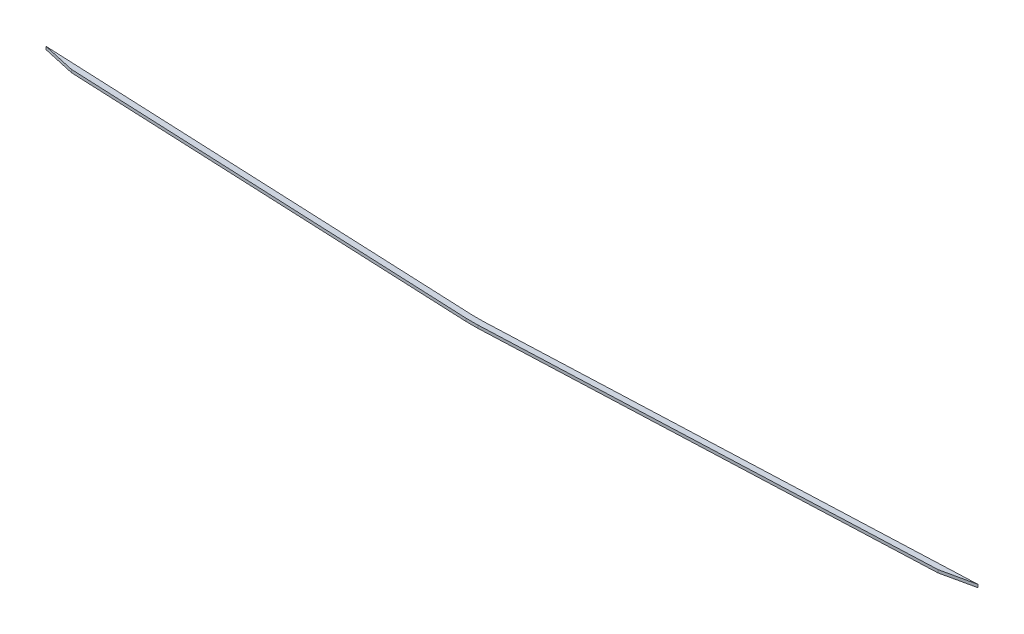
ISO-10303-21;
HEADER;
FILE_DESCRIPTION(('STEP AP214'),'2;1');
FILE_NAME('part.step','',(''),(''),'','','');
FILE_SCHEMA(('AUTOMOTIVE_DESIGN { 1 0 10303 214 1 1 1 1 }'));
ENDSEC;
DATA;
#1=APPLICATION_CONTEXT('core data for automotive mechanical design processes');
#2=APPLICATION_PROTOCOL_DEFINITION('international standard','automotive_design',2000,#1);
#3=PRODUCT_CONTEXT('',#1,'mechanical');
#4=PRODUCT('Part','Part','',(#3));
#5=PRODUCT_RELATED_PRODUCT_CATEGORY('part','',(#4));
#6=PRODUCT_DEFINITION_FORMATION('','',#4);
#7=PRODUCT_DEFINITION_CONTEXT('part definition',#1,'design');
#8=PRODUCT_DEFINITION('design','',#6,#7);
#9=PRODUCT_DEFINITION_SHAPE('','',#8);
#10=(LENGTH_UNIT() NAMED_UNIT(*) SI_UNIT(.MILLI.,.METRE.));
#11=(NAMED_UNIT(*) PLANE_ANGLE_UNIT() SI_UNIT($,.RADIAN.));
#12=(NAMED_UNIT(*) SI_UNIT($,.STERADIAN.) SOLID_ANGLE_UNIT());
#13=UNCERTAINTY_MEASURE_WITH_UNIT(LENGTH_MEASURE(1.E-05),#10,'distance_accuracy_value','');
#14=(GEOMETRIC_REPRESENTATION_CONTEXT(3) GLOBAL_UNCERTAINTY_ASSIGNED_CONTEXT((#13)) GLOBAL_UNIT_ASSIGNED_CONTEXT((#10,
#11,#12)) REPRESENTATION_CONTEXT('',''));
#15=CARTESIAN_POINT('',(0.,0.,0.));
#16=DIRECTION('',(0.,0.,1.));
#17=DIRECTION('',(1.,0.,0.));
#18=AXIS2_PLACEMENT_3D('',#15,#16,#17);
#19=CARTESIAN_POINT('',(-6.,1.5,-6.));
#20=DIRECTION('',(0.,0.,1.));
#21=DIRECTION('',(1.,0.,0.));
#22=AXIS2_PLACEMENT_3D('',#19,#20,#21);
#23=PLANE('',#22);
#24=DIRECTION('',(-1.,0.,0.));
#25=VECTOR('',#24,1.);
#26=CARTESIAN_POINT('',(-6.,-1.5,-6.));
#27=LINE('',#26,#25);
#28=CARTESIAN_POINT('',(6.,-1.5,-6.));
#29=VERTEX_POINT('',#28);
#30=CARTESIAN_POINT('',(-6.,-1.5,-6.));
#31=VERTEX_POINT('',#30);
#32=EDGE_CURVE('E99',#29,#31,#27,.T.);
#33=ORIENTED_EDGE('',*,*,#32,.T.);
#34=DIRECTION('',(0.,-1.,0.));
#35=VECTOR('',#34,1.);
#36=CARTESIAN_POINT('',(-6.,1.5,-6.));
#37=LINE('',#36,#35);
#38=CARTESIAN_POINT('',(-6.,1.5,-6.));
#39=VERTEX_POINT('',#38);
#40=EDGE_CURVE('E11',#39,#31,#37,.T.);
#41=ORIENTED_EDGE('',*,*,#40,.F.);
#42=DIRECTION('',(-1.,0.,0.));
#43=VECTOR('',#42,1.);
#44=CARTESIAN_POINT('',(-6.,1.5,-6.));
#45=LINE('',#44,#43);
#46=CARTESIAN_POINT('',(6.,1.5,-6.));
#47=VERTEX_POINT('',#46);
#48=EDGE_CURVE('E126',#47,#39,#45,.T.);
#49=ORIENTED_EDGE('',*,*,#48,.F.);
#50=DIRECTION('',(0.,-1.,0.));
#51=VECTOR('',#50,1.);
#52=CARTESIAN_POINT('',(6.,1.5,-6.));
#53=LINE('',#52,#51);
#54=EDGE_CURVE('E112',#47,#29,#53,.T.);
#55=ORIENTED_EDGE('',*,*,#54,.T.);
#56=EDGE_LOOP('',(#33,#41,#49,#55));
#57=FACE_BOUND('',#56,.T.);
#58=ADVANCED_FACE('F31',(#57),#23,.F.);
#59=CARTESIAN_POINT('',(-6.,1.5,-6.));
#60=DIRECTION('',(-0.0440101798517303,0.,0.999031082634278));
#61=DIRECTION('',(0.999031082634279,0.,0.0440101798517303));
#62=AXIS2_PLACEMENT_3D('',#59,#60,#61);
#63=PLANE('',#62);
#64=DIRECTION('',(-0.999031082634278,0.,-0.0440101798517303));
#65=VECTOR('',#64,1.);
#66=CARTESIAN_POINT('',(-6.,-1.5,-6.));
#67=LINE('',#66,#65);
#68=CARTESIAN_POINT('',(-465.,-1.5,-26.2202643171806));
#69=VERTEX_POINT('',#68);
#70=EDGE_CURVE('E95',#31,#69,#67,.T.);
#71=ORIENTED_EDGE('',*,*,#70,.T.);
#72=DIRECTION('',(0.,-1.,0.));
#73=VECTOR('',#72,1.);
#74=CARTESIAN_POINT('',(-465.,1.5,-26.2202643171806));
#75=LINE('',#74,#73);
#76=CARTESIAN_POINT('',(-465.,1.5,-26.2202643171806));
#77=VERTEX_POINT('',#76);
#78=EDGE_CURVE('E38',#77,#69,#75,.T.);
#79=ORIENTED_EDGE('',*,*,#78,.F.);
#80=DIRECTION('',(-0.999031082634278,0.,-0.0440101798517303));
#81=VECTOR('',#80,1.);
#82=CARTESIAN_POINT('',(-6.,1.5,-6.));
#83=LINE('',#82,#81);
#84=EDGE_CURVE('E108',#39,#77,#83,.T.);
#85=ORIENTED_EDGE('',*,*,#84,.F.);
#86=ORIENTED_EDGE('',*,*,#40,.T.);
#87=EDGE_LOOP('',(#71,#79,#85,#86));
#88=FACE_BOUND('',#87,.T.);
#89=ADVANCED_FACE('F107',(#88),#63,.F.);
#90=CARTESIAN_POINT('',(-465.,1.5,-26.2202643171806));
#91=DIRECTION('',(0.216821493261509,0.,-0.97621126814837));
#92=DIRECTION('',(-0.976211268148371,0.,-0.216821493261509));
#93=AXIS2_PLACEMENT_3D('',#90,#91,#92);
#94=PLANE('',#93);
#95=DIRECTION('',(0.97621126814837,0.,0.216821493261509));
#96=VECTOR('',#95,1.);
#97=CARTESIAN_POINT('',(-465.,-1.5,-26.2202643171806));
#98=LINE('',#97,#96);
#99=CARTESIAN_POINT('',(-431.302022404104,-1.5,-18.735771912075));
#100=VERTEX_POINT('',#99);
#101=EDGE_CURVE('E101',#69,#100,#98,.T.);
#102=ORIENTED_EDGE('',*,*,#101,.T.);
#103=DIRECTION('',(0.,-1.,0.));
#104=VECTOR('',#103,1.);
#105=CARTESIAN_POINT('',(-431.302022404104,1.5,-18.735771912075));
#106=LINE('',#105,#104);
#107=CARTESIAN_POINT('',(-431.302022404104,1.5,-18.735771912075));
#108=VERTEX_POINT('',#107);
#109=EDGE_CURVE('E152',#108,#100,#106,.T.);
#110=ORIENTED_EDGE('',*,*,#109,.F.);
#111=DIRECTION('',(0.97621126814837,0.,0.216821493261509));
#112=VECTOR('',#111,1.);
#113=CARTESIAN_POINT('',(-465.,1.5,-26.2202643171806));
#114=LINE('',#113,#112);
#115=EDGE_CURVE('E129',#77,#108,#114,.T.);
#116=ORIENTED_EDGE('',*,*,#115,.F.);
#117=ORIENTED_EDGE('',*,*,#78,.T.);
#118=EDGE_LOOP('',(#102,#110,#116,#117));
#119=FACE_BOUND('',#118,.T.);
#120=ADVANCED_FACE('F156',(#119),#94,.F.);
#121=CARTESIAN_POINT('',(-431.302022404104,1.5,-18.735771912075));
#122=DIRECTION('',(0.0440101798517302,0.,-0.999031082634278));
#123=DIRECTION('',(-0.999031082634279,0.,-0.0440101798517302));
#124=AXIS2_PLACEMENT_3D('',#121,#122,#123);
#125=PLANE('',#124);
#126=DIRECTION('',(0.999031082634278,0.,0.0440101798517302));
#127=VECTOR('',#126,1.);
#128=CARTESIAN_POINT('',(-431.302022404104,-1.5,-18.735771912075));
#129=LINE('',#128,#127);
#130=CARTESIAN_POINT('',(-6.,-1.5,0.));
#131=VERTEX_POINT('',#130);
#132=EDGE_CURVE('E116',#100,#131,#129,.T.);
#133=ORIENTED_EDGE('',*,*,#132,.T.);
#134=DIRECTION('',(0.,-1.,0.));
#135=VECTOR('',#134,1.);
#136=CARTESIAN_POINT('',(-6.,1.5,0.));
#137=LINE('',#136,#135);
#138=CARTESIAN_POINT('',(-6.,1.5,0.));
#139=VERTEX_POINT('',#138);
#140=EDGE_CURVE('E149',#139,#131,#137,.T.);
#141=ORIENTED_EDGE('',*,*,#140,.F.);
#142=DIRECTION('',(0.999031082634278,0.,0.0440101798517302));
#143=VECTOR('',#142,1.);
#144=CARTESIAN_POINT('',(-431.302022404104,1.5,-18.735771912075));
#145=LINE('',#144,#143);
#146=EDGE_CURVE('E131',#108,#139,#145,.T.);
#147=ORIENTED_EDGE('',*,*,#146,.F.);
#148=ORIENTED_EDGE('',*,*,#109,.T.);
#149=EDGE_LOOP('',(#133,#141,#147,#148));
#150=FACE_BOUND('',#149,.T.);
#151=ADVANCED_FACE('F164',(#150),#125,.F.);
#152=CARTESIAN_POINT('',(6.,1.5,0.));
#153=DIRECTION('',(0.,0.,-1.));
#154=DIRECTION('',(-1.,0.,0.));
#155=AXIS2_PLACEMENT_3D('',#152,#153,#154);
#156=PLANE('',#155);
#157=DIRECTION('',(1.,0.,0.));
#158=VECTOR('',#157,1.);
#159=CARTESIAN_POINT('',(6.,-1.5,0.));
#160=LINE('',#159,#158);
#161=CARTESIAN_POINT('',(6.,-1.5,0.));
#162=VERTEX_POINT('',#161);
#163=EDGE_CURVE('E118',#131,#162,#160,.T.);
#164=ORIENTED_EDGE('',*,*,#163,.T.);
#165=DIRECTION('',(0.,-1.,0.));
#166=VECTOR('',#165,1.);
#167=CARTESIAN_POINT('',(6.,1.5,0.));
#168=LINE('',#167,#166);
#169=CARTESIAN_POINT('',(6.,1.5,0.));
#170=VERTEX_POINT('',#169);
#171=EDGE_CURVE('E146',#170,#162,#168,.T.);
#172=ORIENTED_EDGE('',*,*,#171,.F.);
#173=DIRECTION('',(1.,0.,0.));
#174=VECTOR('',#173,1.);
#175=CARTESIAN_POINT('',(6.,1.5,0.));
#176=LINE('',#175,#174);
#177=EDGE_CURVE('E133',#139,#170,#176,.T.);
#178=ORIENTED_EDGE('',*,*,#177,.F.);
#179=ORIENTED_EDGE('',*,*,#140,.T.);
#180=EDGE_LOOP('',(#164,#172,#178,#179));
#181=FACE_BOUND('',#180,.T.);
#182=ADVANCED_FACE('F167',(#181),#156,.F.);
#183=CARTESIAN_POINT('',(461.277824715251,1.5,-18.8131332526964));
#184=DIRECTION('',(-0.0412870795456189,0.,-0.999147325003973));
#185=DIRECTION('',(-0.999147325003973,0.,0.0412870795456189));
#186=AXIS2_PLACEMENT_3D('',#183,#184,#185);
#187=PLANE('',#186);
#188=DIRECTION('',(0.999147325003972,0.,-0.0412870795456188));
#189=VECTOR('',#188,1.);
#190=CARTESIAN_POINT('',(461.277824715251,-1.5,-18.8131332526964));
#191=LINE('',#190,#189);
#192=CARTESIAN_POINT('',(461.277824715251,-1.5,-18.8131332526964));
#193=VERTEX_POINT('',#192);
#194=EDGE_CURVE('E120',#162,#193,#191,.T.);
#195=ORIENTED_EDGE('',*,*,#194,.T.);
#196=DIRECTION('',(0.,-1.,0.));
#197=VECTOR('',#196,1.);
#198=CARTESIAN_POINT('',(461.277824715251,1.5,-18.8131332526964));
#199=LINE('',#198,#197);
#200=CARTESIAN_POINT('',(461.277824715251,1.5,-18.8131332526964));
#201=VERTEX_POINT('',#200);
#202=EDGE_CURVE('E143',#201,#193,#199,.T.);
#203=ORIENTED_EDGE('',*,*,#202,.F.);
#204=DIRECTION('',(0.999147325003972,0.,-0.0412870795456188));
#205=VECTOR('',#204,1.);
#206=CARTESIAN_POINT('',(461.277824715251,1.5,-18.8131332526964));
#207=LINE('',#206,#205);
#208=EDGE_CURVE('E135',#170,#201,#207,.T.);
#209=ORIENTED_EDGE('',*,*,#208,.F.);
#210=ORIENTED_EDGE('',*,*,#171,.T.);
#211=EDGE_LOOP('',(#195,#203,#209,#210));
#212=FACE_BOUND('',#211,.T.);
#213=ADVANCED_FACE('F172',(#212),#187,.F.);
#214=CARTESIAN_POINT('',(495.,1.5,-26.2066115702479));
#215=DIRECTION('',(-0.214159948243486,0.,-0.976798605941034));
#216=DIRECTION('',(-0.976798605941034,0.,0.214159948243486));
#217=AXIS2_PLACEMENT_3D('',#214,#215,#216);
#218=PLANE('',#217);
#219=DIRECTION('',(0.976798605941034,0.,-0.214159948243486));
#220=VECTOR('',#219,1.);
#221=CARTESIAN_POINT('',(495.,-1.5,-26.2066115702479));
#222=LINE('',#221,#220);
#223=CARTESIAN_POINT('',(495.,-1.5,-26.2066115702479));
#224=VERTEX_POINT('',#223);
#225=EDGE_CURVE('E122',#193,#224,#222,.T.);
#226=ORIENTED_EDGE('',*,*,#225,.T.);
#227=DIRECTION('',(0.,-1.,0.));
#228=VECTOR('',#227,1.);
#229=CARTESIAN_POINT('',(495.,1.5,-26.2066115702479));
#230=LINE('',#229,#228);
#231=CARTESIAN_POINT('',(495.,1.5,-26.2066115702479));
#232=VERTEX_POINT('',#231);
#233=EDGE_CURVE('E140',#232,#224,#230,.T.);
#234=ORIENTED_EDGE('',*,*,#233,.F.);
#235=DIRECTION('',(0.976798605941034,0.,-0.214159948243486));
#236=VECTOR('',#235,1.);
#237=CARTESIAN_POINT('',(495.,1.5,-26.2066115702479));
#238=LINE('',#237,#236);
#239=EDGE_CURVE('E50',#201,#232,#238,.T.);
#240=ORIENTED_EDGE('',*,*,#239,.F.);
#241=ORIENTED_EDGE('',*,*,#202,.T.);
#242=EDGE_LOOP('',(#226,#234,#240,#241));
#243=FACE_BOUND('',#242,.T.);
#244=ADVANCED_FACE('F175',(#243),#218,.F.);
#245=CARTESIAN_POINT('',(6.,1.5,-6.));
#246=DIRECTION('',(0.0412870795456187,0.,0.999147325003972));
#247=DIRECTION('',(0.999147325003973,0.,-0.0412870795456187));
#248=AXIS2_PLACEMENT_3D('',#245,#246,#247);
#249=PLANE('',#248);
#250=DIRECTION('',(-0.999147325003973,0.,0.0412870795456187));
#251=VECTOR('',#250,1.);
#252=CARTESIAN_POINT('',(6.,-1.5,-6.));
#253=LINE('',#252,#251);
#254=EDGE_CURVE('E124',#224,#29,#253,.T.);
#255=ORIENTED_EDGE('',*,*,#254,.T.);
#256=ORIENTED_EDGE('',*,*,#54,.F.);
#257=DIRECTION('',(-0.999147325003973,0.,0.0412870795456187));
#258=VECTOR('',#257,1.);
#259=CARTESIAN_POINT('',(6.,1.5,-6.));
#260=LINE('',#259,#258);
#261=EDGE_CURVE('E45',#232,#47,#260,.T.);
#262=ORIENTED_EDGE('',*,*,#261,.F.);
#263=ORIENTED_EDGE('',*,*,#233,.T.);
#264=EDGE_LOOP('',(#255,#256,#262,#263));
#265=FACE_BOUND('',#264,.T.);
#266=ADVANCED_FACE('F177',(#265),#249,.F.);
#267=CARTESIAN_POINT('',(-373.960824988126,1.5,-5.99999999999976));
#268=DIRECTION('',(0.,-1.,0.));
#269=DIRECTION('',(0.,0.,-1.));
#270=AXIS2_PLACEMENT_3D('',#267,#268,#269);
#271=PLANE('',#270);
#272=ORIENTED_EDGE('',*,*,#48,.T.);
#273=ORIENTED_EDGE('',*,*,#84,.T.);
#274=ORIENTED_EDGE('',*,*,#115,.T.);
#275=ORIENTED_EDGE('',*,*,#146,.T.);
#276=ORIENTED_EDGE('',*,*,#177,.T.);
#277=ORIENTED_EDGE('',*,*,#208,.T.);
#278=ORIENTED_EDGE('',*,*,#239,.T.);
#279=ORIENTED_EDGE('',*,*,#261,.T.);
#280=EDGE_LOOP('',(#272,#273,#274,#275,#276,#277,#278,#279));
#281=FACE_BOUND('',#280,.T.);
#282=ADVANCED_FACE('F159',(#281),#271,.F.);
#283=CARTESIAN_POINT('',(-373.960824988126,-1.5,-5.99999999999976));
#284=DIRECTION('',(0.,-1.,0.));
#285=DIRECTION('',(0.,0.,-1.));
#286=AXIS2_PLACEMENT_3D('',#283,#284,#285);
#287=PLANE('',#286);
#288=ORIENTED_EDGE('',*,*,#32,.F.);
#289=ORIENTED_EDGE('',*,*,#254,.F.);
#290=ORIENTED_EDGE('',*,*,#225,.F.);
#291=ORIENTED_EDGE('',*,*,#194,.F.);
#292=ORIENTED_EDGE('',*,*,#163,.F.);
#293=ORIENTED_EDGE('',*,*,#132,.F.);
#294=ORIENTED_EDGE('',*,*,#101,.F.);
#295=ORIENTED_EDGE('',*,*,#70,.F.);
#296=EDGE_LOOP('',(#288,#289,#290,#291,#292,#293,#294,#295));
#297=FACE_BOUND('',#296,.T.);
#298=ADVANCED_FACE('F96',(#297),#287,.T.);
#299=CLOSED_SHELL('',(#58,#89,#120,#151,#182,#213,#244,#266,#282,#298));
#300=MANIFOLD_SOLID_BREP('B2',#299);
#301=ADVANCED_BREP_SHAPE_REPRESENTATION('',(#18,#300),#14);
#302=SHAPE_DEFINITION_REPRESENTATION(#9,#301);
ENDSEC;
END-ISO-10303-21;
